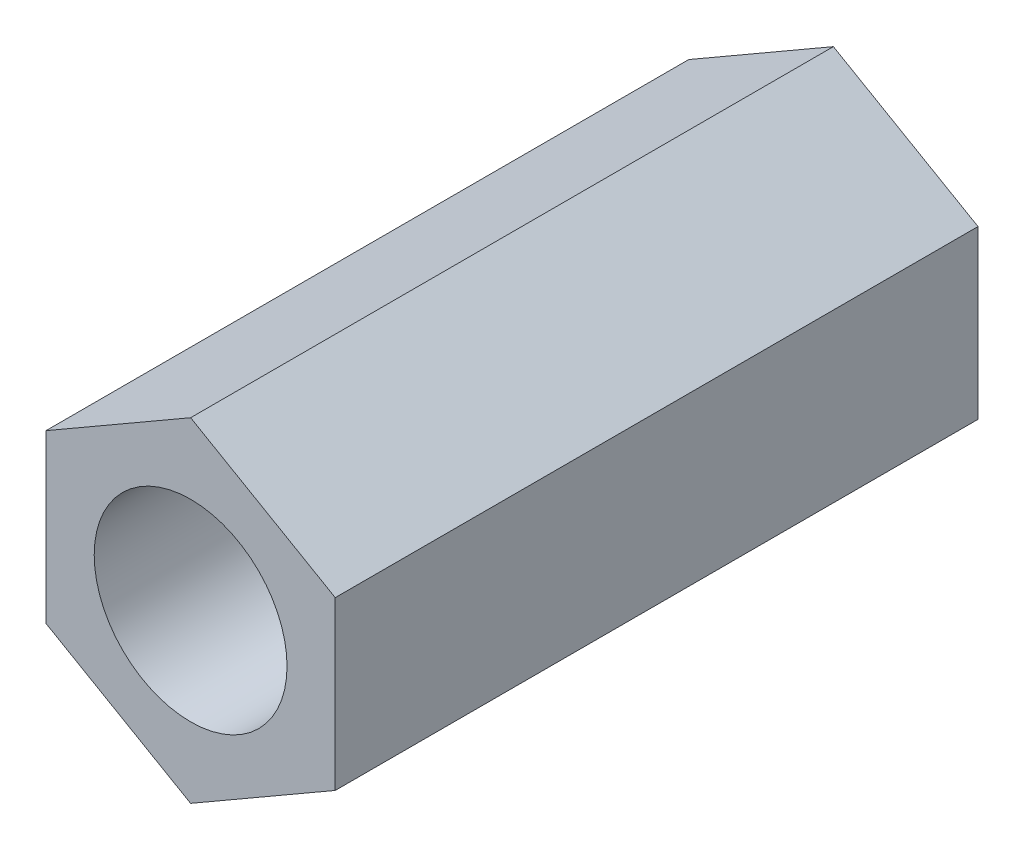
ISO-10303-21;
HEADER;
FILE_DESCRIPTION(('STEP AP214'),'2;1');
FILE_NAME('part.step','',(''),(''),'','','');
FILE_SCHEMA(('AUTOMOTIVE_DESIGN { 1 0 10303 214 1 1 1 1 }'));
ENDSEC;
DATA;
#1=APPLICATION_CONTEXT('core data for automotive mechanical design processes');
#2=APPLICATION_PROTOCOL_DEFINITION('international standard','automotive_design',2000,#1);
#3=PRODUCT_CONTEXT('',#1,'mechanical');
#4=PRODUCT('Part','Part','',(#3));
#5=PRODUCT_RELATED_PRODUCT_CATEGORY('part','',(#4));
#6=PRODUCT_DEFINITION_FORMATION('','',#4);
#7=PRODUCT_DEFINITION_CONTEXT('part definition',#1,'design');
#8=PRODUCT_DEFINITION('design','',#6,#7);
#9=PRODUCT_DEFINITION_SHAPE('','',#8);
#10=(LENGTH_UNIT() NAMED_UNIT(*) SI_UNIT(.MILLI.,.METRE.));
#11=(NAMED_UNIT(*) PLANE_ANGLE_UNIT() SI_UNIT($,.RADIAN.));
#12=(NAMED_UNIT(*) SI_UNIT($,.STERADIAN.) SOLID_ANGLE_UNIT());
#13=UNCERTAINTY_MEASURE_WITH_UNIT(LENGTH_MEASURE(1.E-05),#10,'distance_accuracy_value','');
#14=(GEOMETRIC_REPRESENTATION_CONTEXT(3) GLOBAL_UNCERTAINTY_ASSIGNED_CONTEXT((#13)) GLOBAL_UNIT_ASSIGNED_CONTEXT((#10,
#11,#12)) REPRESENTATION_CONTEXT('',''));
#15=CARTESIAN_POINT('',(0.,0.,0.));
#16=DIRECTION('',(0.,0.,1.));
#17=DIRECTION('',(1.,0.,0.));
#18=AXIS2_PLACEMENT_3D('',#15,#16,#17);
#19=CARTESIAN_POINT('',(0.,2.59807621135332,5.));
#20=DIRECTION('',(0.,0.,1.));
#21=DIRECTION('',(1.,0.,0.));
#22=AXIS2_PLACEMENT_3D('',#19,#20,#21);
#23=PLANE('',#22);
#24=DIRECTION('',(-0.866025403784439,0.499999999999999,0.));
#25=VECTOR('',#24,1.);
#26=CARTESIAN_POINT('',(2.25,1.29903810567666,5.));
#27=LINE('',#26,#25);
#28=CARTESIAN_POINT('',(2.25,1.29903810567666,5.));
#29=VERTEX_POINT('',#28);
#30=CARTESIAN_POINT('',(0.,2.59807621135332,5.));
#31=VERTEX_POINT('',#30);
#32=EDGE_CURVE('E125',#29,#31,#27,.T.);
#33=ORIENTED_EDGE('',*,*,#32,.T.);
#34=DIRECTION('',(-0.866025403784438,-0.5,0.));
#35=VECTOR('',#34,1.);
#36=CARTESIAN_POINT('',(0.,2.59807621135332,5.));
#37=LINE('',#36,#35);
#38=CARTESIAN_POINT('',(-2.25,1.29903810567666,5.));
#39=VERTEX_POINT('',#38);
#40=EDGE_CURVE('E92',#31,#39,#37,.T.);
#41=ORIENTED_EDGE('',*,*,#40,.T.);
#42=DIRECTION('',(0.,-1.,0.));
#43=VECTOR('',#42,1.);
#44=CARTESIAN_POINT('',(-2.25,1.29903810567666,5.));
#45=LINE('',#44,#43);
#46=CARTESIAN_POINT('',(-2.25,-1.29903810567666,5.));
#47=VERTEX_POINT('',#46);
#48=EDGE_CURVE('E128',#39,#47,#45,.T.);
#49=ORIENTED_EDGE('',*,*,#48,.T.);
#50=DIRECTION('',(0.866025403784439,-0.499999999999999,0.));
#51=VECTOR('',#50,1.);
#52=CARTESIAN_POINT('',(-2.25,-1.29903810567666,5.));
#53=LINE('',#52,#51);
#54=CARTESIAN_POINT('',(0.,-2.59807621135331,5.));
#55=VERTEX_POINT('',#54);
#56=EDGE_CURVE('E130',#47,#55,#53,.T.);
#57=ORIENTED_EDGE('',*,*,#56,.T.);
#58=DIRECTION('',(0.866025403784438,0.5,0.));
#59=VECTOR('',#58,1.);
#60=CARTESIAN_POINT('',(0.,-2.59807621135331,5.));
#61=LINE('',#60,#59);
#62=CARTESIAN_POINT('',(2.25,-1.29903810567666,5.));
#63=VERTEX_POINT('',#62);
#64=EDGE_CURVE('E56',#55,#63,#61,.T.);
#65=ORIENTED_EDGE('',*,*,#64,.T.);
#66=DIRECTION('',(0.,1.,0.));
#67=VECTOR('',#66,1.);
#68=CARTESIAN_POINT('',(2.25,-1.29903810567666,5.));
#69=LINE('',#68,#67);
#70=EDGE_CURVE('E51',#63,#29,#69,.T.);
#71=ORIENTED_EDGE('',*,*,#70,.T.);
#72=EDGE_LOOP('',(#33,#41,#49,#57,#65,#71));
#73=FACE_BOUND('',#72,.T.);
#74=CARTESIAN_POINT('',(0.,0.,5.));
#75=DIRECTION('',(0.,0.,1.));
#76=DIRECTION('',(1.,0.,0.));
#77=AXIS2_PLACEMENT_3D('',#74,#75,#76);
#78=CIRCLE('',#77,1.5);
#79=CARTESIAN_POINT('',(1.5,0.,5.));
#80=VERTEX_POINT('',#79);
#81=EDGE_CURVE('E122',#80,#80,#78,.T.);
#82=ORIENTED_EDGE('',*,*,#81,.F.);
#83=EDGE_LOOP('',(#82));
#84=FACE_BOUND('',#83,.T.);
#85=ADVANCED_FACE('F36',(#73,#84),#23,.T.);
#86=CARTESIAN_POINT('',(2.25,1.29903810567666,5.));
#87=DIRECTION('',(-0.499999999999999,-0.866025403784439,0.));
#88=DIRECTION('',(0.866025403784439,-0.499999999999999,0.));
#89=AXIS2_PLACEMENT_3D('',#86,#87,#88);
#90=PLANE('',#89);
#91=DIRECTION('',(0.,0.,-1.));
#92=VECTOR('',#91,1.);
#93=CARTESIAN_POINT('',(2.25,1.29903810567666,5.));
#94=LINE('',#93,#92);
#95=CARTESIAN_POINT('',(2.25,1.29903810567666,-5.));
#96=VERTEX_POINT('',#95);
#97=EDGE_CURVE('E107',#29,#96,#94,.T.);
#98=ORIENTED_EDGE('',*,*,#97,.T.);
#99=DIRECTION('',(-0.866025403784439,0.499999999999999,0.));
#100=VECTOR('',#99,1.);
#101=CARTESIAN_POINT('',(2.25,1.29903810567666,-5.));
#102=LINE('',#101,#100);
#103=CARTESIAN_POINT('',(0.,2.59807621135332,-5.));
#104=VERTEX_POINT('',#103);
#105=EDGE_CURVE('E101',#96,#104,#102,.T.);
#106=ORIENTED_EDGE('',*,*,#105,.T.);
#107=DIRECTION('',(0.,0.,-1.));
#108=VECTOR('',#107,1.);
#109=CARTESIAN_POINT('',(0.,2.59807621135332,5.));
#110=LINE('',#109,#108);
#111=EDGE_CURVE('E11',#31,#104,#110,.T.);
#112=ORIENTED_EDGE('',*,*,#111,.F.);
#113=ORIENTED_EDGE('',*,*,#32,.F.);
#114=EDGE_LOOP('',(#98,#106,#112,#113));
#115=FACE_BOUND('',#114,.T.);
#116=ADVANCED_FACE('F38',(#115),#90,.F.);
#117=CARTESIAN_POINT('',(0.,2.59807621135332,5.));
#118=DIRECTION('',(0.5,-0.866025403784439,0.));
#119=DIRECTION('',(0.866025403784439,0.5,0.));
#120=AXIS2_PLACEMENT_3D('',#117,#118,#119);
#121=PLANE('',#120);
#122=ORIENTED_EDGE('',*,*,#111,.T.);
#123=DIRECTION('',(-0.866025403784438,-0.5,0.));
#124=VECTOR('',#123,1.);
#125=CARTESIAN_POINT('',(0.,2.59807621135332,-5.));
#126=LINE('',#125,#124);
#127=CARTESIAN_POINT('',(-2.25,1.29903810567666,-5.));
#128=VERTEX_POINT('',#127);
#129=EDGE_CURVE('E91',#104,#128,#126,.T.);
#130=ORIENTED_EDGE('',*,*,#129,.T.);
#131=DIRECTION('',(0.,0.,-1.));
#132=VECTOR('',#131,1.);
#133=CARTESIAN_POINT('',(-2.25,1.29903810567666,5.));
#134=LINE('',#133,#132);
#135=EDGE_CURVE('E44',#39,#128,#134,.T.);
#136=ORIENTED_EDGE('',*,*,#135,.F.);
#137=ORIENTED_EDGE('',*,*,#40,.F.);
#138=EDGE_LOOP('',(#122,#130,#136,#137));
#139=FACE_BOUND('',#138,.T.);
#140=ADVANCED_FACE('F89',(#139),#121,.F.);
#141=CARTESIAN_POINT('',(-2.25,1.29903810567666,5.));
#142=DIRECTION('',(1.,0.,0.));
#143=DIRECTION('',(0.,0.,-1.));
#144=AXIS2_PLACEMENT_3D('',#141,#142,#143);
#145=PLANE('',#144);
#146=ORIENTED_EDGE('',*,*,#135,.T.);
#147=DIRECTION('',(0.,-1.,0.));
#148=VECTOR('',#147,1.);
#149=CARTESIAN_POINT('',(-2.25,1.29903810567666,-5.));
#150=LINE('',#149,#148);
#151=CARTESIAN_POINT('',(-2.25,-1.29903810567666,-5.));
#152=VERTEX_POINT('',#151);
#153=EDGE_CURVE('E105',#128,#152,#150,.T.);
#154=ORIENTED_EDGE('',*,*,#153,.T.);
#155=DIRECTION('',(0.,0.,-1.));
#156=VECTOR('',#155,1.);
#157=CARTESIAN_POINT('',(-2.25,-1.29903810567666,5.));
#158=LINE('',#157,#156);
#159=EDGE_CURVE('E139',#47,#152,#158,.T.);
#160=ORIENTED_EDGE('',*,*,#159,.F.);
#161=ORIENTED_EDGE('',*,*,#48,.F.);
#162=EDGE_LOOP('',(#146,#154,#160,#161));
#163=FACE_BOUND('',#162,.T.);
#164=ADVANCED_FACE('F142',(#163),#145,.F.);
#165=CARTESIAN_POINT('',(-2.25,-1.29903810567666,5.));
#166=DIRECTION('',(0.5,0.866025403784439,0.));
#167=DIRECTION('',(-0.866025403784439,0.5,0.));
#168=AXIS2_PLACEMENT_3D('',#165,#166,#167);
#169=PLANE('',#168);
#170=ORIENTED_EDGE('',*,*,#159,.T.);
#171=DIRECTION('',(0.866025403784439,-0.499999999999999,0.));
#172=VECTOR('',#171,1.);
#173=CARTESIAN_POINT('',(-2.25,-1.29903810567666,-5.));
#174=LINE('',#173,#172);
#175=CARTESIAN_POINT('',(0.,-2.59807621135331,-5.));
#176=VERTEX_POINT('',#175);
#177=EDGE_CURVE('E114',#152,#176,#174,.T.);
#178=ORIENTED_EDGE('',*,*,#177,.T.);
#179=DIRECTION('',(0.,0.,-1.));
#180=VECTOR('',#179,1.);
#181=CARTESIAN_POINT('',(0.,-2.59807621135331,5.));
#182=LINE('',#181,#180);
#183=EDGE_CURVE('E137',#55,#176,#182,.T.);
#184=ORIENTED_EDGE('',*,*,#183,.F.);
#185=ORIENTED_EDGE('',*,*,#56,.F.);
#186=EDGE_LOOP('',(#170,#178,#184,#185));
#187=FACE_BOUND('',#186,.T.);
#188=ADVANCED_FACE('F148',(#187),#169,.F.);
#189=CARTESIAN_POINT('',(0.,-2.59807621135331,5.));
#190=DIRECTION('',(-0.5,0.866025403784438,0.));
#191=DIRECTION('',(-0.866025403784439,-0.5,0.));
#192=AXIS2_PLACEMENT_3D('',#189,#190,#191);
#193=PLANE('',#192);
#194=ORIENTED_EDGE('',*,*,#183,.T.);
#195=DIRECTION('',(0.866025403784438,0.5,0.));
#196=VECTOR('',#195,1.);
#197=CARTESIAN_POINT('',(0.,-2.59807621135331,-5.));
#198=LINE('',#197,#196);
#199=CARTESIAN_POINT('',(2.25,-1.29903810567666,-5.));
#200=VERTEX_POINT('',#199);
#201=EDGE_CURVE('E117',#176,#200,#198,.T.);
#202=ORIENTED_EDGE('',*,*,#201,.T.);
#203=DIRECTION('',(0.,0.,-1.));
#204=VECTOR('',#203,1.);
#205=CARTESIAN_POINT('',(2.25,-1.29903810567666,5.));
#206=LINE('',#205,#204);
#207=EDGE_CURVE('E135',#63,#200,#206,.T.);
#208=ORIENTED_EDGE('',*,*,#207,.F.);
#209=ORIENTED_EDGE('',*,*,#64,.F.);
#210=EDGE_LOOP('',(#194,#202,#208,#209));
#211=FACE_BOUND('',#210,.T.);
#212=ADVANCED_FACE('F151',(#211),#193,.F.);
#213=CARTESIAN_POINT('',(2.25,-1.29903810567666,5.));
#214=DIRECTION('',(-1.,0.,0.));
#215=DIRECTION('',(0.,-1.,0.));
#216=AXIS2_PLACEMENT_3D('',#213,#214,#215);
#217=PLANE('',#216);
#218=ORIENTED_EDGE('',*,*,#207,.T.);
#219=DIRECTION('',(0.,1.,0.));
#220=VECTOR('',#219,1.);
#221=CARTESIAN_POINT('',(2.25,-1.29903810567666,-5.));
#222=LINE('',#221,#220);
#223=EDGE_CURVE('E120',#200,#96,#222,.T.);
#224=ORIENTED_EDGE('',*,*,#223,.T.);
#225=ORIENTED_EDGE('',*,*,#97,.F.);
#226=ORIENTED_EDGE('',*,*,#70,.F.);
#227=EDGE_LOOP('',(#218,#224,#225,#226));
#228=FACE_BOUND('',#227,.T.);
#229=ADVANCED_FACE('F153',(#228),#217,.F.);
#230=CARTESIAN_POINT('',(0.,0.,5.));
#231=DIRECTION('',(0.,0.,-1.));
#232=DIRECTION('',(-1.,0.,0.));
#233=AXIS2_PLACEMENT_3D('',#230,#231,#232);
#234=CYLINDRICAL_SURFACE('',#233,1.5);
#235=ORIENTED_EDGE('',*,*,#81,.T.);
#236=EDGE_LOOP('',(#235));
#237=FACE_BOUND('',#236,.T.);
#238=CARTESIAN_POINT('',(0.,0.,-5.));
#239=DIRECTION('',(0.,0.,1.));
#240=DIRECTION('',(1.,0.,0.));
#241=AXIS2_PLACEMENT_3D('',#238,#239,#240);
#242=CIRCLE('',#241,1.5);
#243=CARTESIAN_POINT('',(1.5,0.,-5.));
#244=VERTEX_POINT('',#243);
#245=EDGE_CURVE('E108',#244,#244,#242,.T.);
#246=ORIENTED_EDGE('',*,*,#245,.F.);
#247=EDGE_LOOP('',(#246));
#248=FACE_BOUND('',#247,.T.);
#249=ADVANCED_FACE('F155',(#237,#248),#234,.F.);
#250=CARTESIAN_POINT('',(0.,2.59807621135332,-5.));
#251=DIRECTION('',(0.,0.,1.));
#252=DIRECTION('',(1.,0.,0.));
#253=AXIS2_PLACEMENT_3D('',#250,#251,#252);
#254=PLANE('',#253);
#255=ORIENTED_EDGE('',*,*,#245,.T.);
#256=EDGE_LOOP('',(#255));
#257=FACE_BOUND('',#256,.T.);
#258=ORIENTED_EDGE('',*,*,#105,.F.);
#259=ORIENTED_EDGE('',*,*,#223,.F.);
#260=ORIENTED_EDGE('',*,*,#201,.F.);
#261=ORIENTED_EDGE('',*,*,#177,.F.);
#262=ORIENTED_EDGE('',*,*,#153,.F.);
#263=ORIENTED_EDGE('',*,*,#129,.F.);
#264=EDGE_LOOP('',(#258,#259,#260,#261,#262,#263));
#265=FACE_BOUND('',#264,.T.);
#266=ADVANCED_FACE('F99',(#257,#265),#254,.F.);
#267=CLOSED_SHELL('',(#85,#116,#140,#164,#188,#212,#229,#249,#266));
#268=MANIFOLD_SOLID_BREP('B2',#267);
#269=ADVANCED_BREP_SHAPE_REPRESENTATION('',(#18,#268),#14);
#270=SHAPE_DEFINITION_REPRESENTATION(#9,#269);
ENDSEC;
END-ISO-10303-21;
